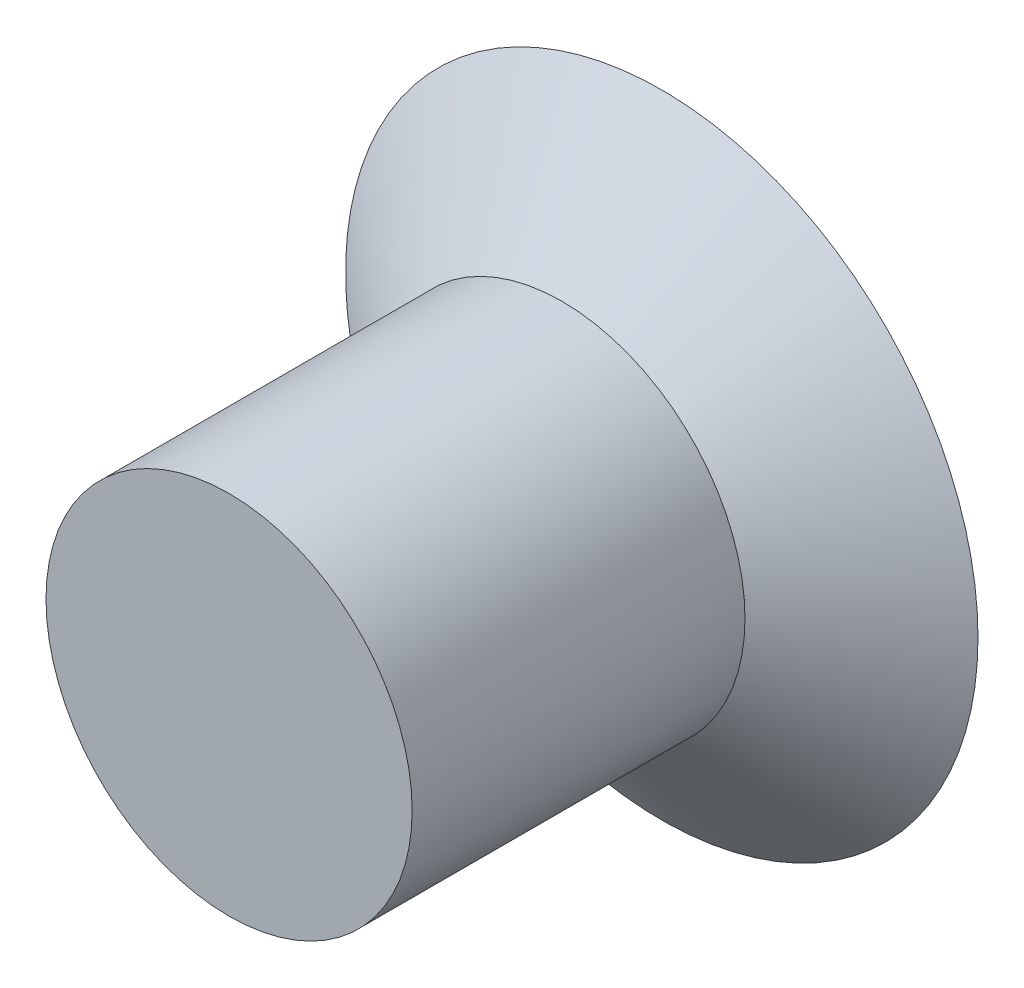
ISO-10303-21;
HEADER;
FILE_DESCRIPTION(('STEP AP214'),'2;1');
FILE_NAME('part.step','',(''),(''),'','','');
FILE_SCHEMA(('AUTOMOTIVE_DESIGN { 1 0 10303 214 1 1 1 1 }'));
ENDSEC;
DATA;
#1=APPLICATION_CONTEXT('core data for automotive mechanical design processes');
#2=APPLICATION_PROTOCOL_DEFINITION('international standard','automotive_design',2000,#1);
#3=PRODUCT_CONTEXT('',#1,'mechanical');
#4=PRODUCT('Part','Part','',(#3));
#5=PRODUCT_RELATED_PRODUCT_CATEGORY('part','',(#4));
#6=PRODUCT_DEFINITION_FORMATION('','',#4);
#7=PRODUCT_DEFINITION_CONTEXT('part definition',#1,'design');
#8=PRODUCT_DEFINITION('design','',#6,#7);
#9=PRODUCT_DEFINITION_SHAPE('','',#8);
#10=(LENGTH_UNIT() NAMED_UNIT(*) SI_UNIT(.MILLI.,.METRE.));
#11=(NAMED_UNIT(*) PLANE_ANGLE_UNIT() SI_UNIT($,.RADIAN.));
#12=(NAMED_UNIT(*) SI_UNIT($,.STERADIAN.) SOLID_ANGLE_UNIT());
#13=UNCERTAINTY_MEASURE_WITH_UNIT(LENGTH_MEASURE(1.E-05),#10,'distance_accuracy_value','');
#14=(GEOMETRIC_REPRESENTATION_CONTEXT(3) GLOBAL_UNCERTAINTY_ASSIGNED_CONTEXT((#13)) GLOBAL_UNIT_ASSIGNED_CONTEXT((#10,
#11,#12)) REPRESENTATION_CONTEXT('',''));
#15=CARTESIAN_POINT('',(0.,0.,0.));
#16=DIRECTION('',(0.,0.,1.));
#17=DIRECTION('',(1.,0.,0.));
#18=AXIS2_PLACEMENT_3D('',#15,#16,#17);
#19=CARTESIAN_POINT('',(0.,0.,0.));
#20=DIRECTION('',(0.,0.,1.));
#21=DIRECTION('',(1.,0.,0.));
#22=AXIS2_PLACEMENT_3D('',#19,#20,#21);
#23=PLANE('',#22);
#24=CARTESIAN_POINT('',(0.,0.,0.));
#25=DIRECTION('',(0.,0.,1.));
#26=DIRECTION('',(1.,0.,0.));
#27=AXIS2_PLACEMENT_3D('',#24,#25,#26);
#28=CIRCLE('',#27,9.5);
#29=CARTESIAN_POINT('',(9.5,0.,0.));
#30=VERTEX_POINT('',#29);
#31=EDGE_CURVE('E11',#30,#30,#28,.T.);
#32=ORIENTED_EDGE('',*,*,#31,.F.);
#33=EDGE_LOOP('',(#32));
#34=FACE_BOUND('',#33,.T.);
#35=ADVANCED_FACE('F40',(#34),#23,.F.);
#36=CARTESIAN_POINT('',(0.,0.,3.));
#37=DIRECTION('',(0.,0.,-1.));
#38=DIRECTION('',(-1.,0.,0.));
#39=AXIS2_PLACEMENT_3D('',#36,#37,#38);
#40=CONICAL_SURFACE('',#39,5.5,0.927295218001612);
#41=CARTESIAN_POINT('',(0.,0.,3.));
#42=DIRECTION('',(0.,0.,1.));
#43=DIRECTION('',(1.,0.,0.));
#44=AXIS2_PLACEMENT_3D('',#41,#42,#43);
#45=CIRCLE('',#44,5.5);
#46=CARTESIAN_POINT('',(5.5,0.,3.));
#47=VERTEX_POINT('',#46);
#48=EDGE_CURVE('E44',#47,#47,#45,.T.);
#49=ORIENTED_EDGE('',*,*,#48,.F.);
#50=EDGE_LOOP('',(#49));
#51=FACE_BOUND('',#50,.T.);
#52=ORIENTED_EDGE('',*,*,#31,.T.);
#53=EDGE_LOOP('',(#52));
#54=FACE_BOUND('',#53,.T.);
#55=ADVANCED_FACE('F77',(#51,#54),#40,.T.);
#56=CARTESIAN_POINT('',(0.,0.,13.));
#57=DIRECTION('',(0.,0.,-1.));
#58=DIRECTION('',(-1.,0.,0.));
#59=AXIS2_PLACEMENT_3D('',#56,#57,#58);
#60=CYLINDRICAL_SURFACE('',#59,5.5);
#61=CARTESIAN_POINT('',(0.,0.,13.));
#62=DIRECTION('',(0.,0.,1.));
#63=DIRECTION('',(1.,0.,0.));
#64=AXIS2_PLACEMENT_3D('',#61,#62,#63);
#65=CIRCLE('',#64,5.5);
#66=CARTESIAN_POINT('',(5.5,0.,13.));
#67=VERTEX_POINT('',#66);
#68=EDGE_CURVE('E54',#67,#67,#65,.T.);
#69=ORIENTED_EDGE('',*,*,#68,.F.);
#70=EDGE_LOOP('',(#69));
#71=FACE_BOUND('',#70,.T.);
#72=ORIENTED_EDGE('',*,*,#48,.T.);
#73=EDGE_LOOP('',(#72));
#74=FACE_BOUND('',#73,.T.);
#75=ADVANCED_FACE('F67',(#71,#74),#60,.T.);
#76=CARTESIAN_POINT('',(0.,0.,13.));
#77=DIRECTION('',(0.,0.,1.));
#78=DIRECTION('',(1.,0.,0.));
#79=AXIS2_PLACEMENT_3D('',#76,#77,#78);
#80=PLANE('',#79);
#81=ORIENTED_EDGE('',*,*,#68,.T.);
#82=EDGE_LOOP('',(#81));
#83=FACE_BOUND('',#82,.T.);
#84=ADVANCED_FACE('F76',(#83),#80,.T.);
#85=CLOSED_SHELL('',(#35,#55,#75,#84));
#86=MANIFOLD_SOLID_BREP('B2',#85);
#87=ADVANCED_BREP_SHAPE_REPRESENTATION('',(#18,#86),#14);
#88=SHAPE_DEFINITION_REPRESENTATION(#9,#87);
ENDSEC;
END-ISO-10303-21;
